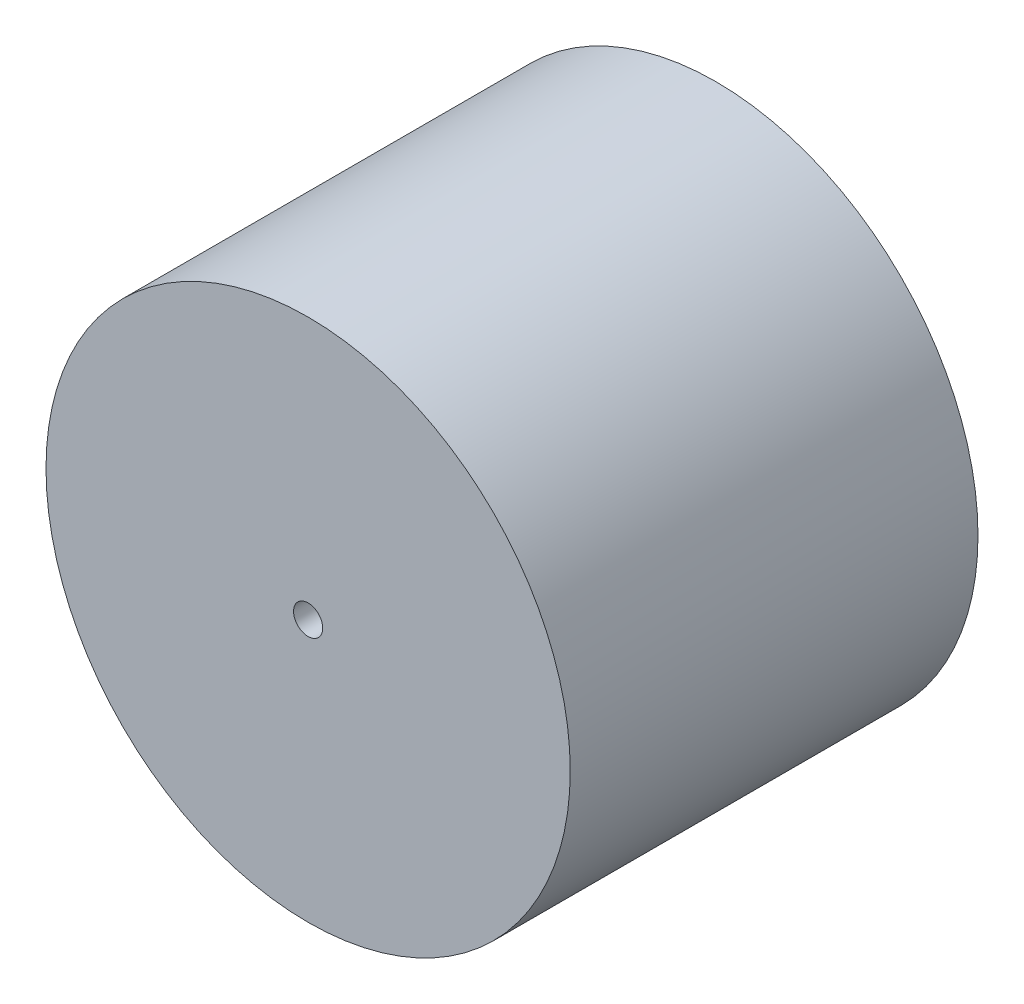
ISO-10303-21;
HEADER;
FILE_DESCRIPTION(('STEP AP214'),'2;1');
FILE_NAME('part.step','',(''),(''),'','','');
FILE_SCHEMA(('AUTOMOTIVE_DESIGN { 1 0 10303 214 1 1 1 1 }'));
ENDSEC;
DATA;
#1=APPLICATION_CONTEXT('core data for automotive mechanical design processes');
#2=APPLICATION_PROTOCOL_DEFINITION('international standard','automotive_design',2000,#1);
#3=PRODUCT_CONTEXT('',#1,'mechanical');
#4=PRODUCT('Part','Part','',(#3));
#5=PRODUCT_RELATED_PRODUCT_CATEGORY('part','',(#4));
#6=PRODUCT_DEFINITION_FORMATION('','',#4);
#7=PRODUCT_DEFINITION_CONTEXT('part definition',#1,'design');
#8=PRODUCT_DEFINITION('design','',#6,#7);
#9=PRODUCT_DEFINITION_SHAPE('','',#8);
#10=(LENGTH_UNIT() NAMED_UNIT(*) SI_UNIT(.MILLI.,.METRE.));
#11=(NAMED_UNIT(*) PLANE_ANGLE_UNIT() SI_UNIT($,.RADIAN.));
#12=(NAMED_UNIT(*) SI_UNIT($,.STERADIAN.) SOLID_ANGLE_UNIT());
#13=UNCERTAINTY_MEASURE_WITH_UNIT(LENGTH_MEASURE(1.E-05),#10,'distance_accuracy_value','');
#14=(GEOMETRIC_REPRESENTATION_CONTEXT(3) GLOBAL_UNCERTAINTY_ASSIGNED_CONTEXT((#13)) GLOBAL_UNIT_ASSIGNED_CONTEXT((#10,
#11,#12)) REPRESENTATION_CONTEXT('',''));
#15=CARTESIAN_POINT('',(0.,0.,0.));
#16=DIRECTION('',(0.,0.,1.));
#17=DIRECTION('',(1.,0.,0.));
#18=AXIS2_PLACEMENT_3D('',#15,#16,#17);
#19=CARTESIAN_POINT('',(-19.4470701217579,20.520011921579,7.));
#20=DIRECTION('',(0.,0.,-1.));
#21=DIRECTION('',(-1.,0.,0.));
#22=AXIS2_PLACEMENT_3D('',#19,#20,#21);
#23=CYLINDRICAL_SURFACE('',#22,9.);
#24=CARTESIAN_POINT('',(-19.4470701217579,20.520011921579,7.));
#25=DIRECTION('',(0.,0.,1.));
#26=DIRECTION('',(1.,0.,0.));
#27=AXIS2_PLACEMENT_3D('',#24,#25,#26);
#28=CIRCLE('',#27,9.);
#29=CARTESIAN_POINT('',(-10.4470701217579,20.520011921579,7.));
#30=VERTEX_POINT('',#29);
#31=EDGE_CURVE('E10',#30,#30,#28,.T.);
#32=ORIENTED_EDGE('',*,*,#31,.F.);
#33=EDGE_LOOP('',(#32));
#34=FACE_BOUND('',#33,.T.);
#35=CARTESIAN_POINT('',(-19.4470701217579,20.520011921579,-7.));
#36=DIRECTION('',(0.,0.,1.));
#37=DIRECTION('',(1.,0.,0.));
#38=AXIS2_PLACEMENT_3D('',#35,#36,#37);
#39=CIRCLE('',#38,9.);
#40=CARTESIAN_POINT('',(-10.4470701217579,20.520011921579,-7.));
#41=VERTEX_POINT('',#40);
#42=EDGE_CURVE('E34',#41,#41,#39,.T.);
#43=ORIENTED_EDGE('',*,*,#42,.T.);
#44=EDGE_LOOP('',(#43));
#45=FACE_BOUND('',#44,.T.);
#46=ADVANCED_FACE('F31',(#34,#45),#23,.T.);
#47=CARTESIAN_POINT('',(-19.4470701217579,20.520011921579,7.));
#48=DIRECTION('',(0.,0.,1.));
#49=DIRECTION('',(1.,0.,0.));
#50=AXIS2_PLACEMENT_3D('',#47,#48,#49);
#51=PLANE('',#50);
#52=CARTESIAN_POINT('',(-19.4470701217579,20.520011921579,7.));
#53=DIRECTION('',(0.,0.,1.));
#54=DIRECTION('',(1.,0.,0.));
#55=AXIS2_PLACEMENT_3D('',#52,#53,#54);
#56=CIRCLE('',#55,0.499999999999999);
#57=CARTESIAN_POINT('',(-18.9470701217579,20.520011921579,7.));
#58=VERTEX_POINT('',#57);
#59=EDGE_CURVE('E43',#58,#58,#56,.T.);
#60=ORIENTED_EDGE('',*,*,#59,.F.);
#61=EDGE_LOOP('',(#60));
#62=FACE_BOUND('',#61,.T.);
#63=ORIENTED_EDGE('',*,*,#31,.T.);
#64=EDGE_LOOP('',(#63));
#65=FACE_BOUND('',#64,.T.);
#66=ADVANCED_FACE('F58',(#62,#65),#51,.T.);
#67=CARTESIAN_POINT('',(-19.4470701217579,20.520011921579,-7.));
#68=DIRECTION('',(0.,0.,1.));
#69=DIRECTION('',(1.,0.,0.));
#70=AXIS2_PLACEMENT_3D('',#67,#68,#69);
#71=PLANE('',#70);
#72=CARTESIAN_POINT('',(-19.4470701217579,20.520011921579,-7.));
#73=DIRECTION('',(0.,0.,1.));
#74=DIRECTION('',(1.,0.,0.));
#75=AXIS2_PLACEMENT_3D('',#72,#73,#74);
#76=CIRCLE('',#75,0.499999999999999);
#77=CARTESIAN_POINT('',(-18.9470701217579,20.520011921579,-7.));
#78=VERTEX_POINT('',#77);
#79=EDGE_CURVE('E41',#78,#78,#76,.T.);
#80=ORIENTED_EDGE('',*,*,#79,.T.);
#81=EDGE_LOOP('',(#80));
#82=FACE_BOUND('',#81,.T.);
#83=ORIENTED_EDGE('',*,*,#42,.F.);
#84=EDGE_LOOP('',(#83));
#85=FACE_BOUND('',#84,.T.);
#86=ADVANCED_FACE('F49',(#82,#85),#71,.F.);
#87=CARTESIAN_POINT('',(-19.4470701217579,20.520011921579,-7.));
#88=DIRECTION('',(0.,0.,1.));
#89=DIRECTION('',(1.,0.,0.));
#90=AXIS2_PLACEMENT_3D('',#87,#88,#89);
#91=CYLINDRICAL_SURFACE('',#90,0.499999999999999);
#92=ORIENTED_EDGE('',*,*,#79,.F.);
#93=EDGE_LOOP('',(#92));
#94=FACE_BOUND('',#93,.T.);
#95=ORIENTED_EDGE('',*,*,#59,.T.);
#96=EDGE_LOOP('',(#95));
#97=FACE_BOUND('',#96,.T.);
#98=ADVANCED_FACE('F52',(#94,#97),#91,.F.);
#99=CLOSED_SHELL('',(#46,#66,#86,#98));
#100=MANIFOLD_SOLID_BREP('B2',#99);
#101=ADVANCED_BREP_SHAPE_REPRESENTATION('',(#18,#100),#14);
#102=SHAPE_DEFINITION_REPRESENTATION(#9,#101);
ENDSEC;
END-ISO-10303-21;
